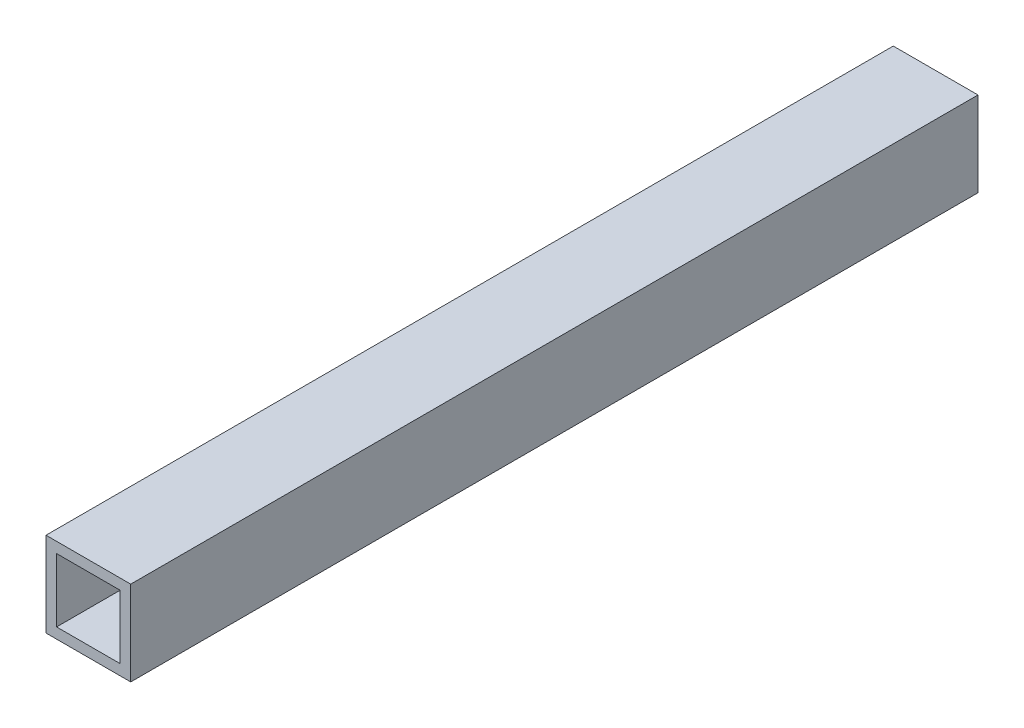
ISO-10303-21;
HEADER;
FILE_DESCRIPTION(('STEP AP214'),'2;1');
FILE_NAME('part.step','',(''),(''),'','','');
FILE_SCHEMA(('AUTOMOTIVE_DESIGN { 1 0 10303 214 1 1 1 1 }'));
ENDSEC;
DATA;
#1=APPLICATION_CONTEXT('core data for automotive mechanical design processes');
#2=APPLICATION_PROTOCOL_DEFINITION('international standard','automotive_design',2000,#1);
#3=PRODUCT_CONTEXT('',#1,'mechanical');
#4=PRODUCT('Part','Part','',(#3));
#5=PRODUCT_RELATED_PRODUCT_CATEGORY('part','',(#4));
#6=PRODUCT_DEFINITION_FORMATION('','',#4);
#7=PRODUCT_DEFINITION_CONTEXT('part definition',#1,'design');
#8=PRODUCT_DEFINITION('design','',#6,#7);
#9=PRODUCT_DEFINITION_SHAPE('','',#8);
#10=(LENGTH_UNIT() NAMED_UNIT(*) SI_UNIT(.MILLI.,.METRE.));
#11=(NAMED_UNIT(*) PLANE_ANGLE_UNIT() SI_UNIT($,.RADIAN.));
#12=(NAMED_UNIT(*) SI_UNIT($,.STERADIAN.) SOLID_ANGLE_UNIT());
#13=UNCERTAINTY_MEASURE_WITH_UNIT(LENGTH_MEASURE(1.E-05),#10,'distance_accuracy_value','');
#14=(GEOMETRIC_REPRESENTATION_CONTEXT(3) GLOBAL_UNCERTAINTY_ASSIGNED_CONTEXT((#13)) GLOBAL_UNIT_ASSIGNED_CONTEXT((#10,
#11,#12)) REPRESENTATION_CONTEXT('',''));
#15=CARTESIAN_POINT('',(0.,0.,0.));
#16=DIRECTION('',(0.,0.,1.));
#17=DIRECTION('',(1.,0.,0.));
#18=AXIS2_PLACEMENT_3D('',#15,#16,#17);
#19=CARTESIAN_POINT('',(9.525,9.525,0.));
#20=DIRECTION('',(1.,0.,0.));
#21=DIRECTION('',(0.,0.,-1.));
#22=AXIS2_PLACEMENT_3D('',#19,#20,#21);
#23=PLANE('',#22);
#24=DIRECTION('',(0.,-1.,0.));
#25=VECTOR('',#24,1.);
#26=CARTESIAN_POINT('',(9.525,4.7625,127.));
#27=LINE('',#26,#25);
#28=CARTESIAN_POINT('',(9.525,9.525,127.));
#29=VERTEX_POINT('',#28);
#30=CARTESIAN_POINT('',(9.525,-9.525,127.));
#31=VERTEX_POINT('',#30);
#32=EDGE_CURVE('E34',#29,#31,#27,.T.);
#33=ORIENTED_EDGE('',*,*,#32,.F.);
#34=DIRECTION('',(0.,0.,-1.));
#35=VECTOR('',#34,1.);
#36=CARTESIAN_POINT('',(9.525,9.525,0.));
#37=LINE('',#36,#35);
#38=CARTESIAN_POINT('',(9.525,9.525,-127.));
#39=VERTEX_POINT('',#38);
#40=EDGE_CURVE('E10',#29,#39,#37,.T.);
#41=ORIENTED_EDGE('',*,*,#40,.T.);
#42=DIRECTION('',(0.,1.,0.));
#43=VECTOR('',#42,1.);
#44=CARTESIAN_POINT('',(9.525,4.7625,-127.));
#45=LINE('',#44,#43);
#46=CARTESIAN_POINT('',(9.525,-9.525,-127.));
#47=VERTEX_POINT('',#46);
#48=EDGE_CURVE('E175',#47,#39,#45,.T.);
#49=ORIENTED_EDGE('',*,*,#48,.F.);
#50=DIRECTION('',(0.,0.,1.));
#51=VECTOR('',#50,1.);
#52=CARTESIAN_POINT('',(9.525,-9.525,0.));
#53=LINE('',#52,#51);
#54=EDGE_CURVE('E26',#47,#31,#53,.T.);
#55=ORIENTED_EDGE('',*,*,#54,.T.);
#56=EDGE_LOOP('',(#33,#41,#49,#55));
#57=FACE_BOUND('',#56,.T.);
#58=ADVANCED_FACE('F16',(#57),#23,.F.);
#59=CARTESIAN_POINT('',(9.525,-9.525,0.));
#60=DIRECTION('',(0.,-1.,0.));
#61=DIRECTION('',(0.,0.,-1.));
#62=AXIS2_PLACEMENT_3D('',#59,#60,#61);
#63=PLANE('',#62);
#64=DIRECTION('',(-1.,0.,0.));
#65=VECTOR('',#64,1.);
#66=CARTESIAN_POINT('',(4.7625,-9.525,127.));
#67=LINE('',#66,#65);
#68=CARTESIAN_POINT('',(-9.525,-9.525,127.));
#69=VERTEX_POINT('',#68);
#70=EDGE_CURVE('E166',#31,#69,#67,.T.);
#71=ORIENTED_EDGE('',*,*,#70,.F.);
#72=ORIENTED_EDGE('',*,*,#54,.F.);
#73=DIRECTION('',(1.,0.,0.));
#74=VECTOR('',#73,1.);
#75=CARTESIAN_POINT('',(4.7625,-9.525,-127.));
#76=LINE('',#75,#74);
#77=CARTESIAN_POINT('',(-9.525,-9.525,-127.));
#78=VERTEX_POINT('',#77);
#79=EDGE_CURVE('E117',#78,#47,#76,.T.);
#80=ORIENTED_EDGE('',*,*,#79,.F.);
#81=DIRECTION('',(0.,0.,1.));
#82=VECTOR('',#81,1.);
#83=CARTESIAN_POINT('',(-9.525,-9.525,0.));
#84=LINE('',#83,#82);
#85=EDGE_CURVE('E159',#78,#69,#84,.T.);
#86=ORIENTED_EDGE('',*,*,#85,.T.);
#87=EDGE_LOOP('',(#71,#72,#80,#86));
#88=FACE_BOUND('',#87,.T.);
#89=ADVANCED_FACE('F142',(#88),#63,.F.);
#90=CARTESIAN_POINT('',(-9.525,-9.525,0.));
#91=DIRECTION('',(-1.,0.,0.));
#92=DIRECTION('',(0.,0.,1.));
#93=AXIS2_PLACEMENT_3D('',#90,#91,#92);
#94=PLANE('',#93);
#95=DIRECTION('',(0.,1.,0.));
#96=VECTOR('',#95,1.);
#97=CARTESIAN_POINT('',(-9.525,-4.7625,127.));
#98=LINE('',#97,#96);
#99=CARTESIAN_POINT('',(-9.525,9.525,127.));
#100=VERTEX_POINT('',#99);
#101=EDGE_CURVE('E157',#69,#100,#98,.T.);
#102=ORIENTED_EDGE('',*,*,#101,.F.);
#103=ORIENTED_EDGE('',*,*,#85,.F.);
#104=DIRECTION('',(0.,-1.,0.));
#105=VECTOR('',#104,1.);
#106=CARTESIAN_POINT('',(-9.525,-4.7625,-127.));
#107=LINE('',#106,#105);
#108=CARTESIAN_POINT('',(-9.525,9.525,-127.));
#109=VERTEX_POINT('',#108);
#110=EDGE_CURVE('E121',#109,#78,#107,.T.);
#111=ORIENTED_EDGE('',*,*,#110,.F.);
#112=DIRECTION('',(0.,0.,1.));
#113=VECTOR('',#112,1.);
#114=CARTESIAN_POINT('',(-9.525,9.525,0.));
#115=LINE('',#114,#113);
#116=EDGE_CURVE('E162',#109,#100,#115,.T.);
#117=ORIENTED_EDGE('',*,*,#116,.T.);
#118=EDGE_LOOP('',(#102,#103,#111,#117));
#119=FACE_BOUND('',#118,.T.);
#120=ADVANCED_FACE('F138',(#119),#94,.F.);
#121=CARTESIAN_POINT('',(-9.525,9.525,0.));
#122=DIRECTION('',(0.,1.,0.));
#123=DIRECTION('',(0.,0.,1.));
#124=AXIS2_PLACEMENT_3D('',#121,#122,#123);
#125=PLANE('',#124);
#126=DIRECTION('',(1.,0.,0.));
#127=VECTOR('',#126,1.);
#128=CARTESIAN_POINT('',(-4.7625,9.525,127.));
#129=LINE('',#128,#127);
#130=EDGE_CURVE('E167',#100,#29,#129,.T.);
#131=ORIENTED_EDGE('',*,*,#130,.F.);
#132=ORIENTED_EDGE('',*,*,#116,.F.);
#133=DIRECTION('',(-1.,0.,0.));
#134=VECTOR('',#133,1.);
#135=CARTESIAN_POINT('',(-4.7625,9.525,-127.));
#136=LINE('',#135,#134);
#137=EDGE_CURVE('E174',#39,#109,#136,.T.);
#138=ORIENTED_EDGE('',*,*,#137,.F.);
#139=ORIENTED_EDGE('',*,*,#40,.F.);
#140=EDGE_LOOP('',(#131,#132,#138,#139));
#141=FACE_BOUND('',#140,.T.);
#142=ADVANCED_FACE('F128',(#141),#125,.F.);
#143=CARTESIAN_POINT('',(0.,0.,-127.));
#144=DIRECTION('',(0.,0.,1.));
#145=DIRECTION('',(1.,0.,0.));
#146=AXIS2_PLACEMENT_3D('',#143,#144,#145);
#147=PLANE('',#146);
#148=ORIENTED_EDGE('',*,*,#48,.T.);
#149=ORIENTED_EDGE('',*,*,#137,.T.);
#150=ORIENTED_EDGE('',*,*,#110,.T.);
#151=ORIENTED_EDGE('',*,*,#79,.T.);
#152=EDGE_LOOP('',(#148,#149,#150,#151));
#153=FACE_BOUND('',#152,.T.);
#154=DIRECTION('',(0.,-1.,0.));
#155=VECTOR('',#154,1.);
#156=CARTESIAN_POINT('',(-12.7,-12.7,-127.));
#157=LINE('',#156,#155);
#158=CARTESIAN_POINT('',(-12.7,12.7,-127.));
#159=VERTEX_POINT('',#158);
#160=CARTESIAN_POINT('',(-12.7,-12.7,-127.));
#161=VERTEX_POINT('',#160);
#162=EDGE_CURVE('E96',#159,#161,#157,.T.);
#163=ORIENTED_EDGE('',*,*,#162,.F.);
#164=DIRECTION('',(-1.,0.,0.));
#165=VECTOR('',#164,1.);
#166=CARTESIAN_POINT('',(-12.7,12.7,-127.));
#167=LINE('',#166,#165);
#168=CARTESIAN_POINT('',(12.7,12.7,-127.));
#169=VERTEX_POINT('',#168);
#170=EDGE_CURVE('E88',#169,#159,#167,.T.);
#171=ORIENTED_EDGE('',*,*,#170,.F.);
#172=DIRECTION('',(0.,1.,0.));
#173=VECTOR('',#172,1.);
#174=CARTESIAN_POINT('',(12.7,12.7,-127.));
#175=LINE('',#174,#173);
#176=CARTESIAN_POINT('',(12.7,-12.7,-127.));
#177=VERTEX_POINT('',#176);
#178=EDGE_CURVE('E111',#177,#169,#175,.T.);
#179=ORIENTED_EDGE('',*,*,#178,.F.);
#180=DIRECTION('',(1.,0.,0.));
#181=VECTOR('',#180,1.);
#182=CARTESIAN_POINT('',(12.7,-12.7,-127.));
#183=LINE('',#182,#181);
#184=EDGE_CURVE('E95',#161,#177,#183,.T.);
#185=ORIENTED_EDGE('',*,*,#184,.F.);
#186=EDGE_LOOP('',(#163,#171,#179,#185));
#187=FACE_BOUND('',#186,.T.);
#188=ADVANCED_FACE('F126',(#153,#187),#147,.F.);
#189=CARTESIAN_POINT('',(12.7,12.7,0.));
#190=DIRECTION('',(1.,0.,0.));
#191=DIRECTION('',(0.,0.,-1.));
#192=AXIS2_PLACEMENT_3D('',#189,#190,#191);
#193=PLANE('',#192);
#194=DIRECTION('',(0.,-1.,0.));
#195=VECTOR('',#194,1.);
#196=CARTESIAN_POINT('',(12.7,12.7,127.));
#197=LINE('',#196,#195);
#198=CARTESIAN_POINT('',(12.7,12.7,127.));
#199=VERTEX_POINT('',#198);
#200=CARTESIAN_POINT('',(12.7,-12.7,127.));
#201=VERTEX_POINT('',#200);
#202=EDGE_CURVE('E100',#199,#201,#197,.T.);
#203=ORIENTED_EDGE('',*,*,#202,.T.);
#204=DIRECTION('',(0.,0.,-1.));
#205=VECTOR('',#204,1.);
#206=CARTESIAN_POINT('',(12.7,-12.7,0.));
#207=LINE('',#206,#205);
#208=EDGE_CURVE('E107',#201,#177,#207,.T.);
#209=ORIENTED_EDGE('',*,*,#208,.T.);
#210=ORIENTED_EDGE('',*,*,#178,.T.);
#211=DIRECTION('',(0.,0.,-1.));
#212=VECTOR('',#211,1.);
#213=CARTESIAN_POINT('',(12.7,12.7,0.));
#214=LINE('',#213,#212);
#215=EDGE_CURVE('E101',#199,#169,#214,.T.);
#216=ORIENTED_EDGE('',*,*,#215,.F.);
#217=EDGE_LOOP('',(#203,#209,#210,#216));
#218=FACE_BOUND('',#217,.T.);
#219=ADVANCED_FACE('F124',(#218),#193,.T.);
#220=CARTESIAN_POINT('',(12.7,-12.7,0.));
#221=DIRECTION('',(0.,-1.,0.));
#222=DIRECTION('',(0.,0.,-1.));
#223=AXIS2_PLACEMENT_3D('',#220,#221,#222);
#224=PLANE('',#223);
#225=DIRECTION('',(-1.,0.,0.));
#226=VECTOR('',#225,1.);
#227=CARTESIAN_POINT('',(12.7,-12.7,127.));
#228=LINE('',#227,#226);
#229=CARTESIAN_POINT('',(-12.7,-12.7,127.));
#230=VERTEX_POINT('',#229);
#231=EDGE_CURVE('E109',#201,#230,#228,.T.);
#232=ORIENTED_EDGE('',*,*,#231,.T.);
#233=DIRECTION('',(0.,0.,-1.));
#234=VECTOR('',#233,1.);
#235=CARTESIAN_POINT('',(-12.7,-12.7,0.));
#236=LINE('',#235,#234);
#237=EDGE_CURVE('E78',#230,#161,#236,.T.);
#238=ORIENTED_EDGE('',*,*,#237,.T.);
#239=ORIENTED_EDGE('',*,*,#184,.T.);
#240=ORIENTED_EDGE('',*,*,#208,.F.);
#241=EDGE_LOOP('',(#232,#238,#239,#240));
#242=FACE_BOUND('',#241,.T.);
#243=ADVANCED_FACE('F136',(#242),#224,.T.);
#244=CARTESIAN_POINT('',(-12.7,-12.7,0.));
#245=DIRECTION('',(-1.,0.,0.));
#246=DIRECTION('',(0.,0.,1.));
#247=AXIS2_PLACEMENT_3D('',#244,#245,#246);
#248=PLANE('',#247);
#249=DIRECTION('',(0.,1.,0.));
#250=VECTOR('',#249,1.);
#251=CARTESIAN_POINT('',(-12.7,-12.7,127.));
#252=LINE('',#251,#250);
#253=CARTESIAN_POINT('',(-12.7,12.7,127.));
#254=VERTEX_POINT('',#253);
#255=EDGE_CURVE('E91',#230,#254,#252,.T.);
#256=ORIENTED_EDGE('',*,*,#255,.T.);
#257=DIRECTION('',(0.,0.,1.));
#258=VECTOR('',#257,1.);
#259=CARTESIAN_POINT('',(-12.7,12.7,0.));
#260=LINE('',#259,#258);
#261=EDGE_CURVE('E84',#159,#254,#260,.T.);
#262=ORIENTED_EDGE('',*,*,#261,.F.);
#263=ORIENTED_EDGE('',*,*,#162,.T.);
#264=ORIENTED_EDGE('',*,*,#237,.F.);
#265=EDGE_LOOP('',(#256,#262,#263,#264));
#266=FACE_BOUND('',#265,.T.);
#267=ADVANCED_FACE('F92',(#266),#248,.T.);
#268=CARTESIAN_POINT('',(-12.7,12.7,0.));
#269=DIRECTION('',(0.,1.,0.));
#270=DIRECTION('',(0.,0.,1.));
#271=AXIS2_PLACEMENT_3D('',#268,#269,#270);
#272=PLANE('',#271);
#273=DIRECTION('',(1.,0.,0.));
#274=VECTOR('',#273,1.);
#275=CARTESIAN_POINT('',(-12.7,12.7,127.));
#276=LINE('',#275,#274);
#277=EDGE_CURVE('E20',#254,#199,#276,.T.);
#278=ORIENTED_EDGE('',*,*,#277,.T.);
#279=ORIENTED_EDGE('',*,*,#215,.T.);
#280=ORIENTED_EDGE('',*,*,#170,.T.);
#281=ORIENTED_EDGE('',*,*,#261,.T.);
#282=EDGE_LOOP('',(#278,#279,#280,#281));
#283=FACE_BOUND('',#282,.T.);
#284=ADVANCED_FACE('F85',(#283),#272,.T.);
#285=CARTESIAN_POINT('',(0.,0.,127.));
#286=DIRECTION('',(0.,0.,1.));
#287=DIRECTION('',(1.,0.,0.));
#288=AXIS2_PLACEMENT_3D('',#285,#286,#287);
#289=PLANE('',#288);
#290=ORIENTED_EDGE('',*,*,#32,.T.);
#291=ORIENTED_EDGE('',*,*,#70,.T.);
#292=ORIENTED_EDGE('',*,*,#101,.T.);
#293=ORIENTED_EDGE('',*,*,#130,.T.);
#294=EDGE_LOOP('',(#290,#291,#292,#293));
#295=FACE_BOUND('',#294,.T.);
#296=ORIENTED_EDGE('',*,*,#202,.F.);
#297=ORIENTED_EDGE('',*,*,#277,.F.);
#298=ORIENTED_EDGE('',*,*,#255,.F.);
#299=ORIENTED_EDGE('',*,*,#231,.F.);
#300=EDGE_LOOP('',(#296,#297,#298,#299));
#301=FACE_BOUND('',#300,.T.);
#302=ADVANCED_FACE('F18',(#295,#301),#289,.T.);
#303=CLOSED_SHELL('',(#58,#89,#120,#142,#188,#219,#243,#267,#284,#302));
#304=MANIFOLD_SOLID_BREP('B1',#303);
#305=ADVANCED_BREP_SHAPE_REPRESENTATION('',(#18,#304),#14);
#306=SHAPE_DEFINITION_REPRESENTATION(#9,#305);
ENDSEC;
END-ISO-10303-21;
